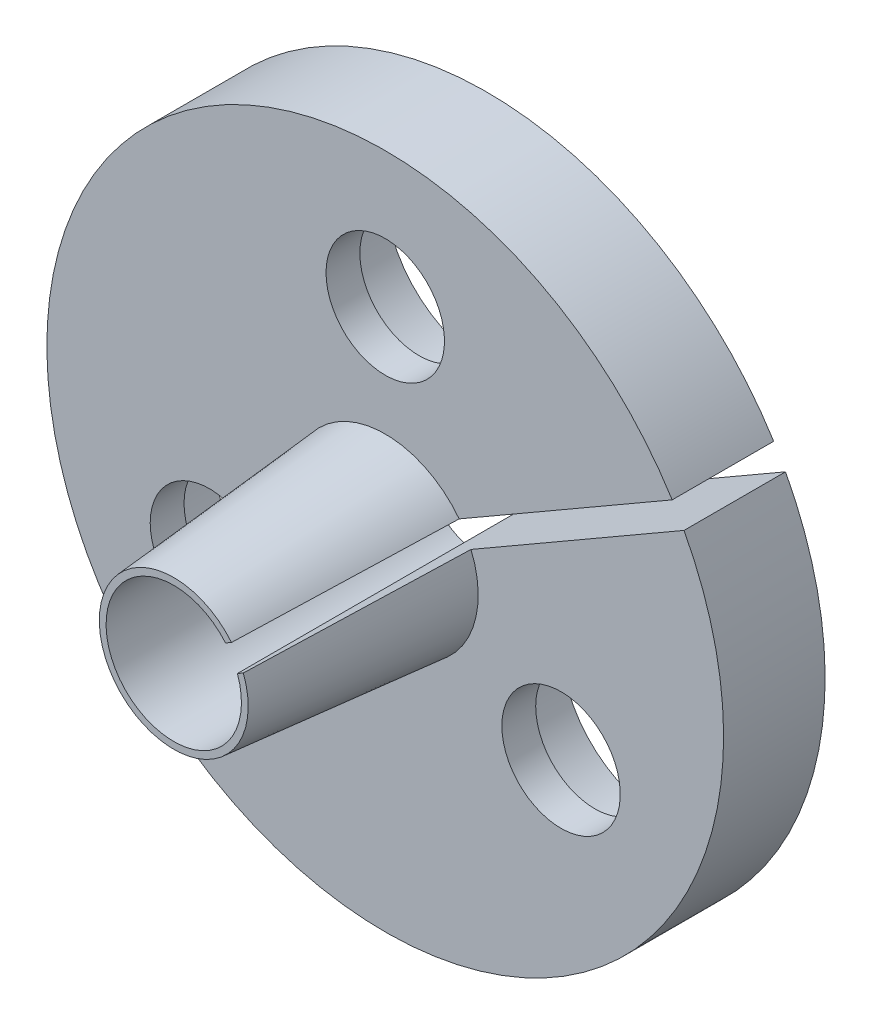
ISO-10303-21;
HEADER;
FILE_DESCRIPTION(('STEP AP214'),'2;1');
FILE_NAME('part.step','',(''),(''),'','','');
FILE_SCHEMA(('AUTOMOTIVE_DESIGN { 1 0 10303 214 1 1 1 1 }'));
ENDSEC;
DATA;
#1=APPLICATION_CONTEXT('core data for automotive mechanical design processes');
#2=APPLICATION_PROTOCOL_DEFINITION('international standard','automotive_design',2000,#1);
#3=PRODUCT_CONTEXT('',#1,'mechanical');
#4=PRODUCT('Part','Part','',(#3));
#5=PRODUCT_RELATED_PRODUCT_CATEGORY('part','',(#4));
#6=PRODUCT_DEFINITION_FORMATION('','',#4);
#7=PRODUCT_DEFINITION_CONTEXT('part definition',#1,'design');
#8=PRODUCT_DEFINITION('design','',#6,#7);
#9=PRODUCT_DEFINITION_SHAPE('','',#8);
#10=(LENGTH_UNIT() NAMED_UNIT(*) SI_UNIT(.MILLI.,.METRE.));
#11=(NAMED_UNIT(*) PLANE_ANGLE_UNIT() SI_UNIT($,.RADIAN.));
#12=(NAMED_UNIT(*) SI_UNIT($,.STERADIAN.) SOLID_ANGLE_UNIT());
#13=UNCERTAINTY_MEASURE_WITH_UNIT(LENGTH_MEASURE(1.E-05),#10,'distance_accuracy_value','');
#14=(GEOMETRIC_REPRESENTATION_CONTEXT(3) GLOBAL_UNCERTAINTY_ASSIGNED_CONTEXT((#13)) GLOBAL_UNIT_ASSIGNED_CONTEXT((#10,
#11,#12)) REPRESENTATION_CONTEXT('',''));
#15=CARTESIAN_POINT('',(0.,0.,0.));
#16=DIRECTION('',(0.,0.,1.));
#17=DIRECTION('',(1.,0.,0.));
#18=AXIS2_PLACEMENT_3D('',#15,#16,#17);
#19=CARTESIAN_POINT('',(-5.19615242270664,-2.99999999999999,6.25));
#20=DIRECTION('',(0.,0.,-1.));
#21=DIRECTION('',(-1.,0.,0.));
#22=AXIS2_PLACEMENT_3D('',#19,#20,#21);
#23=CYLINDRICAL_SURFACE('',#22,1.75);
#24=CARTESIAN_POINT('',(-5.19615242270664,-2.99999999999999,0.));
#25=DIRECTION('',(0.,0.,-1.));
#26=DIRECTION('',(-1.,0.,0.));
#27=AXIS2_PLACEMENT_3D('',#24,#25,#26);
#28=CIRCLE('',#27,1.75);
#29=CARTESIAN_POINT('',(-6.94615242270664,-2.99999999999999,0.));
#30=VERTEX_POINT('',#29);
#31=EDGE_CURVE('E137',#30,#30,#28,.T.);
#32=ORIENTED_EDGE('',*,*,#31,.F.);
#33=EDGE_LOOP('',(#32));
#34=FACE_BOUND('',#33,.T.);
#35=CARTESIAN_POINT('',(-5.19615242270664,-2.99999999999999,-1.));
#36=DIRECTION('',(0.,0.,-1.));
#37=DIRECTION('',(-1.,0.,0.));
#38=AXIS2_PLACEMENT_3D('',#35,#36,#37);
#39=CIRCLE('',#38,1.75);
#40=CARTESIAN_POINT('',(-6.94615242270664,-2.99999999999999,-1.));
#41=VERTEX_POINT('',#40);
#42=EDGE_CURVE('E142',#41,#41,#39,.F.);
#43=ORIENTED_EDGE('',*,*,#42,.F.);
#44=EDGE_LOOP('',(#43));
#45=FACE_BOUND('',#44,.T.);
#46=ADVANCED_FACE('F46',(#34,#45),#23,.F.);
#47=CARTESIAN_POINT('',(5.19615242270664,-2.99999999999999,6.25));
#48=DIRECTION('',(0.,0.,-1.));
#49=DIRECTION('',(-1.,0.,0.));
#50=AXIS2_PLACEMENT_3D('',#47,#48,#49);
#51=CYLINDRICAL_SURFACE('',#50,1.75);
#52=CARTESIAN_POINT('',(5.19615242270664,-2.99999999999999,0.));
#53=DIRECTION('',(0.,0.,-1.));
#54=DIRECTION('',(-1.,0.,0.));
#55=AXIS2_PLACEMENT_3D('',#52,#53,#54);
#56=CIRCLE('',#55,1.75);
#57=CARTESIAN_POINT('',(3.44615242270664,-2.99999999999999,0.));
#58=VERTEX_POINT('',#57);
#59=EDGE_CURVE('E141',#58,#58,#56,.T.);
#60=ORIENTED_EDGE('',*,*,#59,.F.);
#61=EDGE_LOOP('',(#60));
#62=FACE_BOUND('',#61,.T.);
#63=CARTESIAN_POINT('',(5.19615242270664,-2.99999999999999,-1.));
#64=DIRECTION('',(0.,0.,-1.));
#65=DIRECTION('',(-1.,0.,0.));
#66=AXIS2_PLACEMENT_3D('',#63,#64,#65);
#67=CIRCLE('',#66,1.75);
#68=CARTESIAN_POINT('',(3.44615242270664,-2.99999999999999,-1.));
#69=VERTEX_POINT('',#68);
#70=EDGE_CURVE('E154',#69,#69,#67,.F.);
#71=ORIENTED_EDGE('',*,*,#70,.F.);
#72=EDGE_LOOP('',(#71));
#73=FACE_BOUND('',#72,.T.);
#74=ADVANCED_FACE('F166',(#62,#73),#51,.F.);
#75=CARTESIAN_POINT('',(0.,6.,6.25));
#76=DIRECTION('',(0.,0.,-1.));
#77=DIRECTION('',(-1.,0.,0.));
#78=AXIS2_PLACEMENT_3D('',#75,#76,#77);
#79=CYLINDRICAL_SURFACE('',#78,1.75);
#80=CARTESIAN_POINT('',(0.,6.,0.));
#81=DIRECTION('',(0.,0.,-1.));
#82=DIRECTION('',(-1.,0.,0.));
#83=AXIS2_PLACEMENT_3D('',#80,#81,#82);
#84=CIRCLE('',#83,1.75);
#85=CARTESIAN_POINT('',(-1.75,6.,0.));
#86=VERTEX_POINT('',#85);
#87=EDGE_CURVE('E146',#86,#86,#84,.T.);
#88=ORIENTED_EDGE('',*,*,#87,.F.);
#89=EDGE_LOOP('',(#88));
#90=FACE_BOUND('',#89,.T.);
#91=CARTESIAN_POINT('',(0.,6.,-1.));
#92=DIRECTION('',(0.,0.,-1.));
#93=DIRECTION('',(-1.,0.,0.));
#94=AXIS2_PLACEMENT_3D('',#91,#92,#93);
#95=CIRCLE('',#94,1.75);
#96=CARTESIAN_POINT('',(-1.75,6.,-1.));
#97=VERTEX_POINT('',#96);
#98=EDGE_CURVE('E150',#97,#97,#95,.F.);
#99=ORIENTED_EDGE('',*,*,#98,.F.);
#100=EDGE_LOOP('',(#99));
#101=FACE_BOUND('',#100,.T.);
#102=ADVANCED_FACE('F172',(#90,#101),#79,.F.);
#103=CARTESIAN_POINT('',(0.,2.2,6.25));
#104=DIRECTION('',(0.,0.,1.));
#105=DIRECTION('',(0.,-1.,0.));
#106=AXIS2_PLACEMENT_3D('',#103,#104,#105);
#107=PLANE('',#106);
#108=DIRECTION('',(0.866025403784438,0.500000000000001,0.));
#109=VECTOR('',#108,1.);
#110=CARTESIAN_POINT('',(-0.175,0.303108891324553,6.25));
#111=LINE('',#110,#109);
#112=CARTESIAN_POINT('',(1.53032255013531,1.28767732470032,6.25));
#113=VERTEX_POINT('',#112);
#114=CARTESIAN_POINT('',(1.70599043059767,1.38909922277323,6.25));
#115=VERTEX_POINT('',#114);
#116=EDGE_CURVE('E115',#113,#115,#111,.T.);
#117=ORIENTED_EDGE('',*,*,#116,.T.);
#118=CARTESIAN_POINT('',(0.,0.,6.25));
#119=DIRECTION('',(0.,0.,-1.));
#120=DIRECTION('',(0.,1.,0.));
#121=AXIS2_PLACEMENT_3D('',#118,#119,#120);
#122=CIRCLE('',#121,2.2);
#123=CARTESIAN_POINT('',(2.05599043059767,0.782881440124122,6.25));
#124=VERTEX_POINT('',#123);
#125=EDGE_CURVE('E119',#124,#115,#122,.T.);
#126=ORIENTED_EDGE('',*,*,#125,.F.);
#127=DIRECTION('',(-0.866025403784438,-0.500000000000001,0.));
#128=VECTOR('',#127,1.);
#129=CARTESIAN_POINT('',(8.82994800677623,4.69382767020993,6.25));
#130=LINE('',#129,#128);
#131=CARTESIAN_POINT('',(1.88032255013531,0.681459542051209,6.25));
#132=VERTEX_POINT('',#131);
#133=EDGE_CURVE('E265',#124,#132,#130,.T.);
#134=ORIENTED_EDGE('',*,*,#133,.T.);
#135=CARTESIAN_POINT('',(0.,0.,6.25));
#136=DIRECTION('',(0.,0.,-1.));
#137=DIRECTION('',(0.,1.,0.));
#138=AXIS2_PLACEMENT_3D('',#135,#136,#137);
#139=CIRCLE('',#138,2.);
#140=EDGE_CURVE('E105',#132,#113,#139,.T.);
#141=ORIENTED_EDGE('',*,*,#140,.T.);
#142=EDGE_LOOP('',(#117,#126,#134,#141));
#143=FACE_BOUND('',#142,.T.);
#144=ADVANCED_FACE('F48',(#143),#107,.T.);
#145=CARTESIAN_POINT('',(0.,0.,0.));
#146=DIRECTION('',(0.,0.,-1.));
#147=DIRECTION('',(0.,1.,0.));
#148=AXIS2_PLACEMENT_3D('',#145,#146,#147);
#149=CYLINDRICAL_SURFACE('',#148,2.);
#150=DIRECTION('',(0.,0.,-1.));
#151=VECTOR('',#150,1.);
#152=CARTESIAN_POINT('',(1.53032255013531,1.28767732470032,0.));
#153=LINE('',#152,#151);
#154=CARTESIAN_POINT('',(1.53032255013531,1.28767732470032,-3.));
#155=VERTEX_POINT('',#154);
#156=EDGE_CURVE('E212',#113,#155,#153,.T.);
#157=ORIENTED_EDGE('',*,*,#156,.F.);
#158=ORIENTED_EDGE('',*,*,#140,.F.);
#159=DIRECTION('',(0.,0.,-1.));
#160=VECTOR('',#159,1.);
#161=CARTESIAN_POINT('',(1.88032255013531,0.681459542051209,0.));
#162=LINE('',#161,#160);
#163=CARTESIAN_POINT('',(1.88032255013531,0.681459542051209,-3.));
#164=VERTEX_POINT('',#163);
#165=EDGE_CURVE('E273',#164,#132,#162,.F.);
#166=ORIENTED_EDGE('',*,*,#165,.F.);
#167=CARTESIAN_POINT('',(0.,0.,-3.));
#168=DIRECTION('',(0.,0.,-1.));
#169=DIRECTION('',(-1.,0.,0.));
#170=AXIS2_PLACEMENT_3D('',#167,#168,#169);
#171=CIRCLE('',#170,2.);
#172=EDGE_CURVE('E113',#164,#155,#171,.T.);
#173=ORIENTED_EDGE('',*,*,#172,.T.);
#174=EDGE_LOOP('',(#157,#158,#166,#173));
#175=FACE_BOUND('',#174,.T.);
#176=ADVANCED_FACE('F190',(#175),#149,.F.);
#177=CARTESIAN_POINT('',(0.,0.,0.));
#178=DIRECTION('',(0.,0.,-1.));
#179=DIRECTION('',(0.,1.,0.));
#180=AXIS2_PLACEMENT_3D('',#177,#178,#179);
#181=CONICAL_SURFACE('',#180,2.74680414703703,0.0872664625997165);
#182=CARTESIAN_POINT('',(2.18442723158219,1.66532483861187,-0.0002));
#183=CARTESIAN_POINT('',(2.1203377381042,1.62832275230012,0.838746630430985));
#184=CARTESIAN_POINT('',(2.0562103320507,1.5912987771527,1.6776894072637));
#185=CARTESIAN_POINT('',(1.9278460674653,1.51718763443999,3.35556377925688));
#186=CARTESIAN_POINT('',(1.86360920893547,1.4801004668759,4.19449537441754));
#187=CARTESIAN_POINT('',(1.76820958908282,1.42502147067339,5.43901487921796));
#188=CARTESIAN_POINT('',(1.73710164657782,1.40706129169419,5.84460839192085));
#189=CARTESIAN_POINT('',(1.70597508162966,1.38909036104242,6.2502));
#190=B_SPLINE_CURVE_WITH_KNOTS('',3,(#182,#183,#184,#185,#186,#187,#188,#189),.UNSPECIFIED.,.F.,
.F.,(4,2,2,4),(0.,2.52661288234923,5.05322571706744,6.27476872664939),.UNSPECIFIED.);
#191=CARTESIAN_POINT('',(2.184411953567,1.66531601784568,0.));
#192=VERTEX_POINT('',#191);
#193=EDGE_CURVE('E203',#192,#115,#190,.T.);
#194=ORIENTED_EDGE('',*,*,#193,.F.);
#195=CARTESIAN_POINT('',(0.,0.,0.));
#196=DIRECTION('',(0.,0.,-1.));
#197=DIRECTION('',(0.,1.,0.));
#198=AXIS2_PLACEMENT_3D('',#195,#196,#197);
#199=CIRCLE('',#198,2.74680414703703);
#200=CARTESIAN_POINT('',(2.534411953567,1.05909823519658,0.));
#201=VERTEX_POINT('',#200);
#202=EDGE_CURVE('E125',#201,#192,#199,.T.);
#203=ORIENTED_EDGE('',*,*,#202,.F.);
#204=CARTESIAN_POINT('',(2.05597508162966,0.782872578393311,6.25019999999999));
#205=CARTESIAN_POINT('',(2.15906841155989,0.842393540180183,4.90638698960534));
#206=CARTESIAN_POINT('',(2.26201589955348,0.901830300085679,3.56255909888846));
#207=CARTESIAN_POINT('',(2.42139828697449,0.993849764367289,1.47908205954208));
#208=CARTESIAN_POINT('',(2.47793484896508,1.02649116365161,0.739443283592294));
#209=CARTESIAN_POINT('',(2.53442723158219,1.05910705596276,-0.000200000000000307));
#210=B_SPLINE_CURVE_WITH_KNOTS('',3,(#204,#205,#206,#207,#208,#209),.UNSPECIFIED.,.F.,.F.,(4,2,
4),(0.,4.04722606512503,6.27476871659033),.UNSPECIFIED.);
#211=EDGE_CURVE('E194',#124,#201,#210,.T.);
#212=ORIENTED_EDGE('',*,*,#211,.F.);
#213=ORIENTED_EDGE('',*,*,#125,.T.);
#214=EDGE_LOOP('',(#194,#203,#212,#213));
#215=FACE_BOUND('',#214,.T.);
#216=ADVANCED_FACE('F181',(#215),#181,.T.);
#217=CARTESIAN_POINT('',(0.,0.,-3.));
#218=DIRECTION('',(0.,0.,-1.));
#219=DIRECTION('',(-1.,0.,0.));
#220=AXIS2_PLACEMENT_3D('',#217,#218,#219);
#221=PLANE('',#220);
#222=DIRECTION('',(0.866025403784438,0.500000000000001,0.));
#223=VECTOR('',#222,1.);
#224=CARTESIAN_POINT('',(-0.175,0.303108891324553,-3.));
#225=LINE('',#224,#223);
#226=CARTESIAN_POINT('',(8.47994800677623,5.30004545285904,-3.));
#227=VERTEX_POINT('',#226);
#228=EDGE_CURVE('E70',#155,#227,#225,.T.);
#229=ORIENTED_EDGE('',*,*,#228,.F.);
#230=ORIENTED_EDGE('',*,*,#172,.F.);
#231=DIRECTION('',(-0.866025403784438,-0.500000000000001,0.));
#232=VECTOR('',#231,1.);
#233=CARTESIAN_POINT('',(8.82994800677623,4.69382767020993,-3.));
#234=LINE('',#233,#232);
#235=CARTESIAN_POINT('',(8.82994800677623,4.69382767020993,-3.));
#236=VERTEX_POINT('',#235);
#237=EDGE_CURVE('E98',#236,#164,#234,.T.);
#238=ORIENTED_EDGE('',*,*,#237,.F.);
#239=CARTESIAN_POINT('',(0.,0.,-3.));
#240=DIRECTION('',(0.,0.,-1.));
#241=DIRECTION('',(-1.,0.,0.));
#242=AXIS2_PLACEMENT_3D('',#239,#240,#241);
#243=CIRCLE('',#242,10.);
#244=EDGE_CURVE('E111',#236,#227,#243,.T.);
#245=ORIENTED_EDGE('',*,*,#244,.T.);
#246=EDGE_LOOP('',(#229,#230,#238,#245));
#247=FACE_BOUND('',#246,.T.);
#248=CARTESIAN_POINT('',(0.,6.,-3.));
#249=DIRECTION('',(0.,0.,-1.));
#250=DIRECTION('',(-1.,0.,0.));
#251=AXIS2_PLACEMENT_3D('',#248,#249,#250);
#252=CIRCLE('',#251,3.);
#253=CARTESIAN_POINT('',(-3.,6.,-3.));
#254=VERTEX_POINT('',#253);
#255=EDGE_CURVE('E292',#254,#254,#252,.T.);
#256=ORIENTED_EDGE('',*,*,#255,.F.);
#257=EDGE_LOOP('',(#256));
#258=FACE_BOUND('',#257,.T.);
#259=CARTESIAN_POINT('',(-5.19615242270664,-2.99999999999999,-3.));
#260=DIRECTION('',(0.,0.,-1.));
#261=DIRECTION('',(-1.,0.,0.));
#262=AXIS2_PLACEMENT_3D('',#259,#260,#261);
#263=CIRCLE('',#262,3.);
#264=CARTESIAN_POINT('',(-8.19615242270664,-2.99999999999999,-3.));
#265=VERTEX_POINT('',#264);
#266=EDGE_CURVE('E284',#265,#265,#263,.T.);
#267=ORIENTED_EDGE('',*,*,#266,.F.);
#268=EDGE_LOOP('',(#267));
#269=FACE_BOUND('',#268,.T.);
#270=CARTESIAN_POINT('',(5.19615242270664,-2.99999999999999,-3.));
#271=DIRECTION('',(0.,0.,-1.));
#272=DIRECTION('',(-1.,0.,0.));
#273=AXIS2_PLACEMENT_3D('',#270,#271,#272);
#274=CIRCLE('',#273,3.);
#275=CARTESIAN_POINT('',(2.19615242270664,-2.99999999999999,-3.));
#276=VERTEX_POINT('',#275);
#277=EDGE_CURVE('E278',#276,#276,#274,.T.);
#278=ORIENTED_EDGE('',*,*,#277,.F.);
#279=EDGE_LOOP('',(#278));
#280=FACE_BOUND('',#279,.T.);
#281=ADVANCED_FACE('F109',(#247,#258,#269,#280),#221,.T.);
#282=CARTESIAN_POINT('',(0.,0.,0.));
#283=DIRECTION('',(0.,0.,-1.));
#284=DIRECTION('',(-1.,0.,0.));
#285=AXIS2_PLACEMENT_3D('',#282,#283,#284);
#286=PLANE('',#285);
#287=ORIENTED_EDGE('',*,*,#87,.T.);
#288=EDGE_LOOP('',(#287));
#289=FACE_BOUND('',#288,.T.);
#290=ORIENTED_EDGE('',*,*,#59,.T.);
#291=EDGE_LOOP('',(#290));
#292=FACE_BOUND('',#291,.T.);
#293=ORIENTED_EDGE('',*,*,#31,.T.);
#294=EDGE_LOOP('',(#293));
#295=FACE_BOUND('',#294,.T.);
#296=ORIENTED_EDGE('',*,*,#202,.T.);
#297=DIRECTION('',(0.866025403784438,0.500000000000001,0.));
#298=VECTOR('',#297,1.);
#299=CARTESIAN_POINT('',(-0.175,0.303108891324553,0.));
#300=LINE('',#299,#298);
#301=CARTESIAN_POINT('',(8.47994800677623,5.30004545285904,0.));
#302=VERTEX_POINT('',#301);
#303=EDGE_CURVE('E213',#192,#302,#300,.T.);
#304=ORIENTED_EDGE('',*,*,#303,.T.);
#305=CARTESIAN_POINT('',(0.,0.,0.));
#306=DIRECTION('',(0.,0.,-1.));
#307=DIRECTION('',(-1.,0.,0.));
#308=AXIS2_PLACEMENT_3D('',#305,#306,#307);
#309=CIRCLE('',#308,10.);
#310=CARTESIAN_POINT('',(8.82994800677623,4.69382767020993,0.));
#311=VERTEX_POINT('',#310);
#312=EDGE_CURVE('E120',#311,#302,#309,.T.);
#313=ORIENTED_EDGE('',*,*,#312,.F.);
#314=DIRECTION('',(-0.866025403784438,-0.500000000000001,0.));
#315=VECTOR('',#314,1.);
#316=CARTESIAN_POINT('',(0.175,-0.303108891324553,0.));
#317=LINE('',#316,#315);
#318=EDGE_CURVE('E62',#311,#201,#317,.T.);
#319=ORIENTED_EDGE('',*,*,#318,.T.);
#320=EDGE_LOOP('',(#296,#304,#313,#319));
#321=FACE_BOUND('',#320,.T.);
#322=ADVANCED_FACE('F180',(#289,#292,#295,#321),#286,.F.);
#323=CARTESIAN_POINT('',(0.,0.,-3.));
#324=DIRECTION('',(0.,0.,1.));
#325=DIRECTION('',(1.,0.,0.));
#326=AXIS2_PLACEMENT_3D('',#323,#324,#325);
#327=CYLINDRICAL_SURFACE('',#326,10.);
#328=ORIENTED_EDGE('',*,*,#312,.T.);
#329=DIRECTION('',(0.,0.,1.));
#330=VECTOR('',#329,1.);
#331=CARTESIAN_POINT('',(8.47994800677623,5.30004545285904,-3.));
#332=LINE('',#331,#330);
#333=EDGE_CURVE('E12',#302,#227,#332,.F.);
#334=ORIENTED_EDGE('',*,*,#333,.T.);
#335=ORIENTED_EDGE('',*,*,#244,.F.);
#336=DIRECTION('',(0.,0.,1.));
#337=VECTOR('',#336,1.);
#338=CARTESIAN_POINT('',(8.82994800677623,4.69382767020993,-3.));
#339=LINE('',#338,#337);
#340=EDGE_CURVE('E55',#236,#311,#339,.T.);
#341=ORIENTED_EDGE('',*,*,#340,.T.);
#342=EDGE_LOOP('',(#328,#334,#335,#341));
#343=FACE_BOUND('',#342,.T.);
#344=ADVANCED_FACE('F117',(#343),#327,.T.);
#345=CARTESIAN_POINT('',(0.,6.,-1.));
#346=DIRECTION('',(0.,0.,-1.));
#347=DIRECTION('',(-1.,0.,0.));
#348=AXIS2_PLACEMENT_3D('',#345,#346,#347);
#349=PLANE('',#348);
#350=CARTESIAN_POINT('',(0.,6.,-1.));
#351=DIRECTION('',(0.,0.,-1.));
#352=DIRECTION('',(-1.,0.,0.));
#353=AXIS2_PLACEMENT_3D('',#350,#351,#352);
#354=CIRCLE('',#353,3.);
#355=CARTESIAN_POINT('',(-3.,6.,-1.));
#356=VERTEX_POINT('',#355);
#357=EDGE_CURVE('E155',#356,#356,#354,.T.);
#358=ORIENTED_EDGE('',*,*,#357,.T.);
#359=EDGE_LOOP('',(#358));
#360=FACE_BOUND('',#359,.T.);
#361=ORIENTED_EDGE('',*,*,#98,.T.);
#362=EDGE_LOOP('',(#361));
#363=FACE_BOUND('',#362,.T.);
#364=ADVANCED_FACE('F187',(#360,#363),#349,.T.);
#365=CARTESIAN_POINT('',(0.,6.,-1.));
#366=DIRECTION('',(0.,0.,-1.));
#367=DIRECTION('',(-1.,0.,0.));
#368=AXIS2_PLACEMENT_3D('',#365,#366,#367);
#369=CYLINDRICAL_SURFACE('',#368,3.);
#370=ORIENTED_EDGE('',*,*,#357,.F.);
#371=EDGE_LOOP('',(#370));
#372=FACE_BOUND('',#371,.T.);
#373=ORIENTED_EDGE('',*,*,#255,.T.);
#374=EDGE_LOOP('',(#373));
#375=FACE_BOUND('',#374,.T.);
#376=ADVANCED_FACE('F222',(#372,#375),#369,.F.);
#377=CARTESIAN_POINT('',(5.19615242270664,-2.99999999999999,-1.));
#378=DIRECTION('',(0.,0.,-1.));
#379=DIRECTION('',(-1.,0.,0.));
#380=AXIS2_PLACEMENT_3D('',#377,#378,#379);
#381=PLANE('',#380);
#382=CARTESIAN_POINT('',(5.19615242270664,-2.99999999999999,-1.));
#383=DIRECTION('',(0.,0.,-1.));
#384=DIRECTION('',(-1.,0.,0.));
#385=AXIS2_PLACEMENT_3D('',#382,#383,#384);
#386=CIRCLE('',#385,3.);
#387=CARTESIAN_POINT('',(2.19615242270664,-2.99999999999999,-1.));
#388=VERTEX_POINT('',#387);
#389=EDGE_CURVE('E281',#388,#388,#386,.T.);
#390=ORIENTED_EDGE('',*,*,#389,.T.);
#391=EDGE_LOOP('',(#390));
#392=FACE_BOUND('',#391,.T.);
#393=ORIENTED_EDGE('',*,*,#70,.T.);
#394=EDGE_LOOP('',(#393));
#395=FACE_BOUND('',#394,.T.);
#396=ADVANCED_FACE('F226',(#392,#395),#381,.T.);
#397=CARTESIAN_POINT('',(5.19615242270664,-2.99999999999999,-1.));
#398=DIRECTION('',(0.,0.,-1.));
#399=DIRECTION('',(-1.,0.,0.));
#400=AXIS2_PLACEMENT_3D('',#397,#398,#399);
#401=CYLINDRICAL_SURFACE('',#400,3.);
#402=ORIENTED_EDGE('',*,*,#389,.F.);
#403=EDGE_LOOP('',(#402));
#404=FACE_BOUND('',#403,.T.);
#405=ORIENTED_EDGE('',*,*,#277,.T.);
#406=EDGE_LOOP('',(#405));
#407=FACE_BOUND('',#406,.T.);
#408=ADVANCED_FACE('F231',(#404,#407),#401,.F.);
#409=CARTESIAN_POINT('',(-5.19615242270664,-2.99999999999999,-1.));
#410=DIRECTION('',(0.,0.,-1.));
#411=DIRECTION('',(-1.,0.,0.));
#412=AXIS2_PLACEMENT_3D('',#409,#410,#411);
#413=PLANE('',#412);
#414=CARTESIAN_POINT('',(-5.19615242270664,-2.99999999999999,-1.));
#415=DIRECTION('',(0.,0.,-1.));
#416=DIRECTION('',(-1.,0.,0.));
#417=AXIS2_PLACEMENT_3D('',#414,#415,#416);
#418=CIRCLE('',#417,3.);
#419=CARTESIAN_POINT('',(-8.19615242270664,-2.99999999999999,-1.));
#420=VERTEX_POINT('',#419);
#421=EDGE_CURVE('E288',#420,#420,#418,.T.);
#422=ORIENTED_EDGE('',*,*,#421,.T.);
#423=EDGE_LOOP('',(#422));
#424=FACE_BOUND('',#423,.T.);
#425=ORIENTED_EDGE('',*,*,#42,.T.);
#426=EDGE_LOOP('',(#425));
#427=FACE_BOUND('',#426,.T.);
#428=ADVANCED_FACE('F163',(#424,#427),#413,.T.);
#429=CARTESIAN_POINT('',(-5.19615242270664,-2.99999999999999,-1.));
#430=DIRECTION('',(0.,0.,-1.));
#431=DIRECTION('',(-1.,0.,0.));
#432=AXIS2_PLACEMENT_3D('',#429,#430,#431);
#433=CYLINDRICAL_SURFACE('',#432,3.);
#434=ORIENTED_EDGE('',*,*,#421,.F.);
#435=EDGE_LOOP('',(#434));
#436=FACE_BOUND('',#435,.T.);
#437=ORIENTED_EDGE('',*,*,#266,.T.);
#438=EDGE_LOOP('',(#437));
#439=FACE_BOUND('',#438,.T.);
#440=ADVANCED_FACE('F230',(#436,#439),#433,.F.);
#441=CARTESIAN_POINT('',(8.82994800677623,4.69382767020993,6.25));
#442=DIRECTION('',(0.500000000000001,-0.866025403784438,0.));
#443=DIRECTION('',(0.866025403784438,0.500000000000001,0.));
#444=AXIS2_PLACEMENT_3D('',#441,#442,#443);
#445=PLANE('',#444);
#446=ORIENTED_EDGE('',*,*,#165,.T.);
#447=ORIENTED_EDGE('',*,*,#133,.F.);
#448=ORIENTED_EDGE('',*,*,#211,.T.);
#449=ORIENTED_EDGE('',*,*,#318,.F.);
#450=ORIENTED_EDGE('',*,*,#340,.F.);
#451=ORIENTED_EDGE('',*,*,#237,.T.);
#452=EDGE_LOOP('',(#446,#447,#448,#449,#450,#451));
#453=FACE_BOUND('',#452,.T.);
#454=ADVANCED_FACE('F97',(#453),#445,.F.);
#455=CARTESIAN_POINT('',(-0.175,0.303108891324553,6.25));
#456=DIRECTION('',(-0.500000000000001,0.866025403784438,0.));
#457=DIRECTION('',(-0.866025403784438,-0.500000000000001,0.));
#458=AXIS2_PLACEMENT_3D('',#455,#456,#457);
#459=PLANE('',#458);
#460=ORIENTED_EDGE('',*,*,#156,.T.);
#461=ORIENTED_EDGE('',*,*,#228,.T.);
#462=ORIENTED_EDGE('',*,*,#333,.F.);
#463=ORIENTED_EDGE('',*,*,#303,.F.);
#464=ORIENTED_EDGE('',*,*,#193,.T.);
#465=ORIENTED_EDGE('',*,*,#116,.F.);
#466=EDGE_LOOP('',(#460,#461,#462,#463,#464,#465));
#467=FACE_BOUND('',#466,.T.);
#468=ADVANCED_FACE('F215',(#467),#459,.F.);
#469=CLOSED_SHELL('',(#46,#74,#102,#144,#176,#216,#281,#322,#344,#364,#376,#396,#408,#428,#440,
#454,#468));
#470=MANIFOLD_SOLID_BREP('B2',#469);
#471=ADVANCED_BREP_SHAPE_REPRESENTATION('',(#18,#470),#14);
#472=SHAPE_DEFINITION_REPRESENTATION(#9,#471);
ENDSEC;
END-ISO-10303-21;
